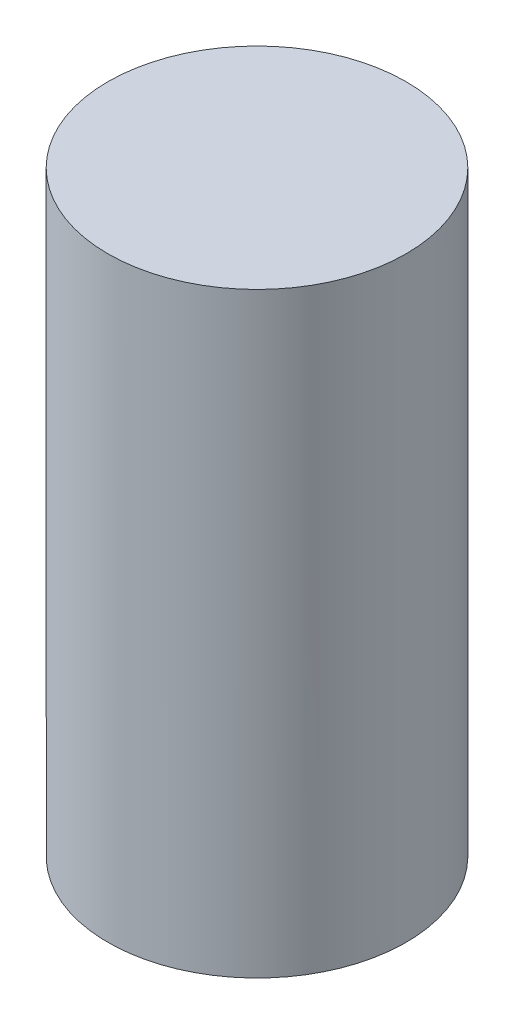
ISO-10303-21;
HEADER;
FILE_DESCRIPTION(('STEP AP214'),'2;1');
FILE_NAME('part.step','',(''),(''),'','','');
FILE_SCHEMA(('AUTOMOTIVE_DESIGN { 1 0 10303 214 1 1 1 1 }'));
ENDSEC;
DATA;
#1=APPLICATION_CONTEXT('core data for automotive mechanical design processes');
#2=APPLICATION_PROTOCOL_DEFINITION('international standard','automotive_design',2000,#1);
#3=PRODUCT_CONTEXT('',#1,'mechanical');
#4=PRODUCT('Part','Part','',(#3));
#5=PRODUCT_RELATED_PRODUCT_CATEGORY('part','',(#4));
#6=PRODUCT_DEFINITION_FORMATION('','',#4);
#7=PRODUCT_DEFINITION_CONTEXT('part definition',#1,'design');
#8=PRODUCT_DEFINITION('design','',#6,#7);
#9=PRODUCT_DEFINITION_SHAPE('','',#8);
#10=(LENGTH_UNIT() NAMED_UNIT(*) SI_UNIT(.MILLI.,.METRE.));
#11=(NAMED_UNIT(*) PLANE_ANGLE_UNIT() SI_UNIT($,.RADIAN.));
#12=(NAMED_UNIT(*) SI_UNIT($,.STERADIAN.) SOLID_ANGLE_UNIT());
#13=UNCERTAINTY_MEASURE_WITH_UNIT(LENGTH_MEASURE(1.E-05),#10,'distance_accuracy_value','');
#14=(GEOMETRIC_REPRESENTATION_CONTEXT(3) GLOBAL_UNCERTAINTY_ASSIGNED_CONTEXT((#13)) GLOBAL_UNIT_ASSIGNED_CONTEXT((#10,
#11,#12)) REPRESENTATION_CONTEXT('',''));
#15=CARTESIAN_POINT('',(0.,0.,0.));
#16=DIRECTION('',(0.,0.,1.));
#17=DIRECTION('',(1.,0.,0.));
#18=AXIS2_PLACEMENT_3D('',#15,#16,#17);
#19=CARTESIAN_POINT('',(0.,0.125,0.));
#20=DIRECTION('',(0.,-1.,0.));
#21=DIRECTION('',(0.,0.,-1.));
#22=AXIS2_PLACEMENT_3D('',#19,#20,#21);
#23=CYLINDRICAL_SURFACE('',#22,0.375);
#24=CARTESIAN_POINT('',(0.,0.75,0.));
#25=DIRECTION('',(0.,1.,0.));
#26=DIRECTION('',(0.,0.,1.));
#27=AXIS2_PLACEMENT_3D('',#24,#25,#26);
#28=CIRCLE('',#27,0.375);
#29=CARTESIAN_POINT('',(0.,0.75,0.375));
#30=VERTEX_POINT('',#29);
#31=EDGE_CURVE('E10',#30,#30,#28,.T.);
#32=ORIENTED_EDGE('',*,*,#31,.F.);
#33=EDGE_LOOP('',(#32));
#34=FACE_BOUND('',#33,.T.);
#35=CARTESIAN_POINT('',(0.,-0.75,0.));
#36=DIRECTION('',(0.,-1.,0.));
#37=DIRECTION('',(0.,0.,-1.));
#38=AXIS2_PLACEMENT_3D('',#35,#36,#37);
#39=CIRCLE('',#38,0.375);
#40=CARTESIAN_POINT('',(0.,-0.75,-0.375));
#41=VERTEX_POINT('',#40);
#42=EDGE_CURVE('E45',#41,#41,#39,.T.);
#43=ORIENTED_EDGE('',*,*,#42,.F.);
#44=EDGE_LOOP('',(#43));
#45=FACE_BOUND('',#44,.T.);
#46=ADVANCED_FACE('F39',(#34,#45),#23,.T.);
#47=CARTESIAN_POINT('',(0.,0.75,0.));
#48=DIRECTION('',(0.,1.,0.));
#49=DIRECTION('',(0.,0.,1.));
#50=AXIS2_PLACEMENT_3D('',#47,#48,#49);
#51=PLANE('',#50);
#52=ORIENTED_EDGE('',*,*,#31,.T.);
#53=EDGE_LOOP('',(#52));
#54=FACE_BOUND('',#53,.T.);
#55=ADVANCED_FACE('F54',(#54),#51,.T.);
#56=CARTESIAN_POINT('',(0.,-0.75,0.));
#57=DIRECTION('',(0.,-1.,0.));
#58=DIRECTION('',(0.,0.,-1.));
#59=AXIS2_PLACEMENT_3D('',#56,#57,#58);
#60=PLANE('',#59);
#61=ORIENTED_EDGE('',*,*,#42,.T.);
#62=EDGE_LOOP('',(#61));
#63=FACE_BOUND('',#62,.T.);
#64=ADVANCED_FACE('F51',(#63),#60,.T.);
#65=CLOSED_SHELL('',(#46,#55,#64));
#66=MANIFOLD_SOLID_BREP('B2',#65);
#67=ADVANCED_BREP_SHAPE_REPRESENTATION('',(#18,#66),#14);
#68=SHAPE_DEFINITION_REPRESENTATION(#9,#67);
ENDSEC;
END-ISO-10303-21;
